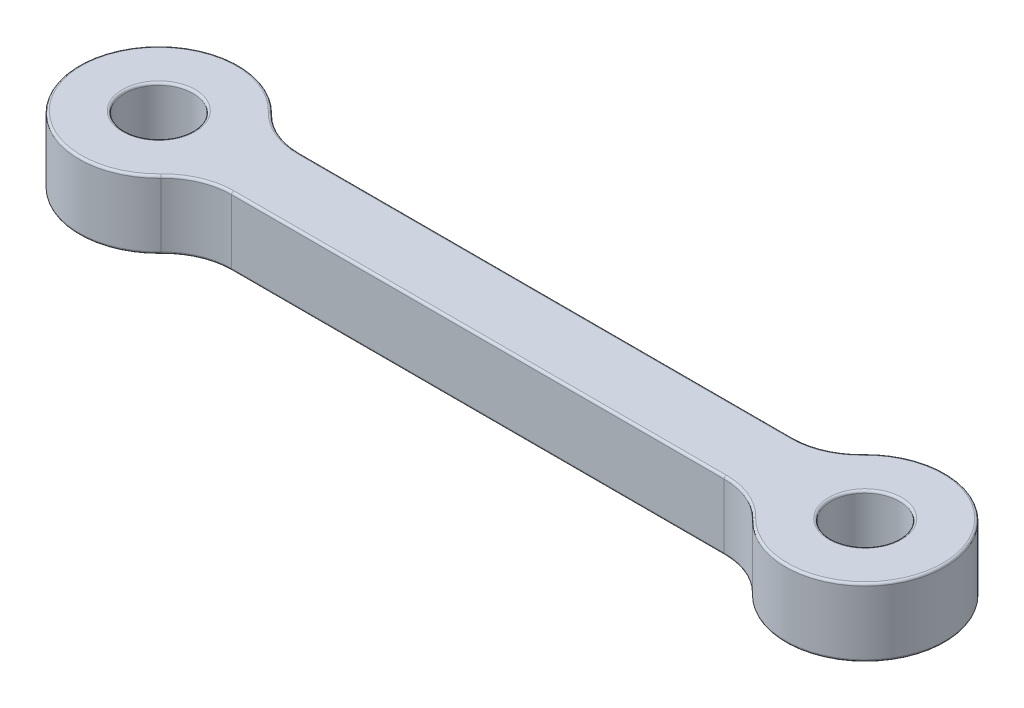
ISO-10303-21;
HEADER;
FILE_DESCRIPTION(('STEP AP214'),'2;1');
FILE_NAME('part.step','',(''),(''),'','','');
FILE_SCHEMA(('AUTOMOTIVE_DESIGN { 1 0 10303 214 1 1 1 1 }'));
ENDSEC;
DATA;
#1=APPLICATION_CONTEXT('core data for automotive mechanical design processes');
#2=APPLICATION_PROTOCOL_DEFINITION('international standard','automotive_design',2000,#1);
#3=PRODUCT_CONTEXT('',#1,'mechanical');
#4=PRODUCT('Part','Part','',(#3));
#5=PRODUCT_RELATED_PRODUCT_CATEGORY('part','',(#4));
#6=PRODUCT_DEFINITION_FORMATION('','',#4);
#7=PRODUCT_DEFINITION_CONTEXT('part definition',#1,'design');
#8=PRODUCT_DEFINITION('design','',#6,#7);
#9=PRODUCT_DEFINITION_SHAPE('','',#8);
#10=(LENGTH_UNIT() NAMED_UNIT(*) SI_UNIT(.MILLI.,.METRE.));
#11=(NAMED_UNIT(*) PLANE_ANGLE_UNIT() SI_UNIT($,.RADIAN.));
#12=(NAMED_UNIT(*) SI_UNIT($,.STERADIAN.) SOLID_ANGLE_UNIT());
#13=UNCERTAINTY_MEASURE_WITH_UNIT(LENGTH_MEASURE(1.E-05),#10,'distance_accuracy_value','');
#14=(GEOMETRIC_REPRESENTATION_CONTEXT(3) GLOBAL_UNCERTAINTY_ASSIGNED_CONTEXT((#13)) GLOBAL_UNIT_ASSIGNED_CONTEXT((#10,
#11,#12)) REPRESENTATION_CONTEXT('',''));
#15=CARTESIAN_POINT('',(0.,0.,0.));
#16=DIRECTION('',(0.,0.,1.));
#17=DIRECTION('',(1.,0.,0.));
#18=AXIS2_PLACEMENT_3D('',#15,#16,#17);
#19=CARTESIAN_POINT('',(0.,3.,-1.5));
#20=DIRECTION('',(0.,0.,-1.));
#21=DIRECTION('',(-1.,0.,0.));
#22=AXIS2_PLACEMENT_3D('',#19,#20,#21);
#23=PLANE('',#22);
#24=DIRECTION('',(0.,-1.,0.));
#25=VECTOR('',#24,1.);
#26=CARTESIAN_POINT('',(26.3095842401766,3.,-1.5));
#27=LINE('',#26,#25);
#28=CARTESIAN_POINT('',(26.3095842401766,2.9,-1.5));
#29=VERTEX_POINT('',#28);
#30=CARTESIAN_POINT('',(26.3095842401766,0.0999999999999998,-1.5));
#31=VERTEX_POINT('',#30);
#32=EDGE_CURVE('E348',#29,#31,#27,.T.);
#33=ORIENTED_EDGE('',*,*,#32,.T.);
#34=DIRECTION('',(1.,0.,0.));
#35=VECTOR('',#34,1.);
#36=CARTESIAN_POINT('',(4.69041575982343,0.1,-1.5));
#37=LINE('',#36,#35);
#38=CARTESIAN_POINT('',(4.69041575982343,0.0999999999999998,-1.5));
#39=VERTEX_POINT('',#38);
#40=EDGE_CURVE('E273',#31,#39,#37,.F.);
#41=ORIENTED_EDGE('',*,*,#40,.T.);
#42=DIRECTION('',(0.,-1.,0.));
#43=VECTOR('',#42,1.);
#44=CARTESIAN_POINT('',(4.69041575982343,3.,-1.5));
#45=LINE('',#44,#43);
#46=CARTESIAN_POINT('',(4.69041575982343,2.9,-1.5));
#47=VERTEX_POINT('',#46);
#48=EDGE_CURVE('E180',#47,#39,#45,.T.);
#49=ORIENTED_EDGE('',*,*,#48,.F.);
#50=DIRECTION('',(1.,0.,0.));
#51=VECTOR('',#50,1.);
#52=CARTESIAN_POINT('',(0.,2.9,-1.5));
#53=LINE('',#52,#51);
#54=EDGE_CURVE('E270',#47,#29,#53,.T.);
#55=ORIENTED_EDGE('',*,*,#54,.T.);
#56=EDGE_LOOP('',(#33,#41,#49,#55));
#57=FACE_BOUND('',#56,.T.);
#58=ADVANCED_FACE('F41',(#57),#23,.T.);
#59=CARTESIAN_POINT('',(4.69041575982343,3.,-4.5));
#60=DIRECTION('',(0.,-1.,0.));
#61=DIRECTION('',(0.,0.,-1.));
#62=AXIS2_PLACEMENT_3D('',#59,#60,#61);
#63=CYLINDRICAL_SURFACE('',#62,3.);
#64=ORIENTED_EDGE('',*,*,#48,.T.);
#65=CARTESIAN_POINT('',(4.69041575982343,0.0999999999999998,-4.5));
#66=DIRECTION('',(0.,1.,0.));
#67=DIRECTION('',(0.,0.,1.));
#68=AXIS2_PLACEMENT_3D('',#65,#66,#67);
#69=CIRCLE('',#68,3.);
#70=CARTESIAN_POINT('',(2.52560848605877,0.0999999999999998,-2.42307692307692));
#71=VERTEX_POINT('',#70);
#72=EDGE_CURVE('E178',#39,#71,#69,.F.);
#73=ORIENTED_EDGE('',*,*,#72,.T.);
#74=DIRECTION('',(0.,-1.,0.));
#75=VECTOR('',#74,1.);
#76=CARTESIAN_POINT('',(2.52560848605877,3.,-2.42307692307692));
#77=LINE('',#76,#75);
#78=CARTESIAN_POINT('',(2.52560848605877,2.9,-2.42307692307692));
#79=VERTEX_POINT('',#78);
#80=EDGE_CURVE('E159',#79,#71,#77,.T.);
#81=ORIENTED_EDGE('',*,*,#80,.F.);
#82=CARTESIAN_POINT('',(4.69041575982343,2.9,-4.5));
#83=DIRECTION('',(0.,1.,0.));
#84=DIRECTION('',(0.,0.,1.));
#85=AXIS2_PLACEMENT_3D('',#82,#83,#84);
#86=CIRCLE('',#85,3.);
#87=EDGE_CURVE('E175',#79,#47,#86,.T.);
#88=ORIENTED_EDGE('',*,*,#87,.T.);
#89=EDGE_LOOP('',(#64,#73,#81,#88));
#90=FACE_BOUND('',#89,.T.);
#91=ADVANCED_FACE('F173',(#90),#63,.F.);
#92=CARTESIAN_POINT('',(0.,3.,0.));
#93=DIRECTION('',(0.,-1.,0.));
#94=DIRECTION('',(0.,0.,-1.));
#95=AXIS2_PLACEMENT_3D('',#92,#93,#94);
#96=CYLINDRICAL_SURFACE('',#95,3.5);
#97=ORIENTED_EDGE('',*,*,#80,.T.);
#98=CARTESIAN_POINT('',(0.,0.0999999999999998,0.));
#99=DIRECTION('',(0.,1.,0.));
#100=DIRECTION('',(0.,0.,1.));
#101=AXIS2_PLACEMENT_3D('',#98,#99,#100);
#102=CIRCLE('',#101,3.5);
#103=CARTESIAN_POINT('',(2.52560848605877,0.0999999999999998,2.42307692307692));
#104=VERTEX_POINT('',#103);
#105=EDGE_CURVE('E167',#71,#104,#102,.T.);
#106=ORIENTED_EDGE('',*,*,#105,.T.);
#107=DIRECTION('',(0.,-1.,0.));
#108=VECTOR('',#107,1.);
#109=CARTESIAN_POINT('',(2.52560848605877,3.,2.42307692307692));
#110=LINE('',#109,#108);
#111=CARTESIAN_POINT('',(2.52560848605877,2.9,2.42307692307692));
#112=VERTEX_POINT('',#111);
#113=EDGE_CURVE('E161',#112,#104,#110,.T.);
#114=ORIENTED_EDGE('',*,*,#113,.F.);
#115=CARTESIAN_POINT('',(0.,2.9,0.));
#116=DIRECTION('',(0.,1.,0.));
#117=DIRECTION('',(0.,0.,1.));
#118=AXIS2_PLACEMENT_3D('',#115,#116,#117);
#119=CIRCLE('',#118,3.5);
#120=EDGE_CURVE('E156',#112,#79,#119,.F.);
#121=ORIENTED_EDGE('',*,*,#120,.T.);
#122=EDGE_LOOP('',(#97,#106,#114,#121));
#123=FACE_BOUND('',#122,.T.);
#124=ADVANCED_FACE('F158',(#123),#96,.T.);
#125=CARTESIAN_POINT('',(4.69041575982343,3.,4.5));
#126=DIRECTION('',(0.,-1.,0.));
#127=DIRECTION('',(0.,0.,-1.));
#128=AXIS2_PLACEMENT_3D('',#125,#126,#127);
#129=CYLINDRICAL_SURFACE('',#128,3.);
#130=ORIENTED_EDGE('',*,*,#113,.T.);
#131=CARTESIAN_POINT('',(4.69041575982343,0.0999999999999998,4.5));
#132=DIRECTION('',(0.,1.,0.));
#133=DIRECTION('',(0.,0.,1.));
#134=AXIS2_PLACEMENT_3D('',#131,#132,#133);
#135=CIRCLE('',#134,3.);
#136=CARTESIAN_POINT('',(4.69041575982343,0.0999999999999998,1.5));
#137=VERTEX_POINT('',#136);
#138=EDGE_CURVE('E242',#104,#137,#135,.F.);
#139=ORIENTED_EDGE('',*,*,#138,.T.);
#140=DIRECTION('',(0.,-1.,0.));
#141=VECTOR('',#140,1.);
#142=CARTESIAN_POINT('',(4.69041575982343,3.,1.5));
#143=LINE('',#142,#141);
#144=CARTESIAN_POINT('',(4.69041575982343,2.9,1.5));
#145=VERTEX_POINT('',#144);
#146=EDGE_CURVE('E405',#145,#137,#143,.T.);
#147=ORIENTED_EDGE('',*,*,#146,.F.);
#148=CARTESIAN_POINT('',(4.69041575982343,2.9,4.5));
#149=DIRECTION('',(0.,1.,0.));
#150=DIRECTION('',(0.,0.,1.));
#151=AXIS2_PLACEMENT_3D('',#148,#149,#150);
#152=CIRCLE('',#151,3.);
#153=EDGE_CURVE('E239',#145,#112,#152,.T.);
#154=ORIENTED_EDGE('',*,*,#153,.T.);
#155=EDGE_LOOP('',(#130,#139,#147,#154));
#156=FACE_BOUND('',#155,.T.);
#157=ADVANCED_FACE('F412',(#156),#129,.F.);
#158=CARTESIAN_POINT('',(0.,3.,1.5));
#159=DIRECTION('',(0.,0.,-1.));
#160=DIRECTION('',(-1.,0.,0.));
#161=AXIS2_PLACEMENT_3D('',#158,#159,#160);
#162=PLANE('',#161);
#163=ORIENTED_EDGE('',*,*,#146,.T.);
#164=DIRECTION('',(1.,0.,0.));
#165=VECTOR('',#164,1.);
#166=CARTESIAN_POINT('',(0.,0.0999999999999998,1.5));
#167=LINE('',#166,#165);
#168=CARTESIAN_POINT('',(26.3095842401766,0.0999999999999998,1.5));
#169=VERTEX_POINT('',#168);
#170=EDGE_CURVE('E248',#137,#169,#167,.T.);
#171=ORIENTED_EDGE('',*,*,#170,.T.);
#172=DIRECTION('',(0.,-1.,0.));
#173=VECTOR('',#172,1.);
#174=CARTESIAN_POINT('',(26.3095842401766,3.,1.5));
#175=LINE('',#174,#173);
#176=CARTESIAN_POINT('',(26.3095842401766,2.9,1.5));
#177=VERTEX_POINT('',#176);
#178=EDGE_CURVE('E401',#177,#169,#175,.T.);
#179=ORIENTED_EDGE('',*,*,#178,.F.);
#180=DIRECTION('',(1.,0.,0.));
#181=VECTOR('',#180,1.);
#182=CARTESIAN_POINT('',(4.69041575982343,2.9,1.5));
#183=LINE('',#182,#181);
#184=EDGE_CURVE('E245',#177,#145,#183,.F.);
#185=ORIENTED_EDGE('',*,*,#184,.T.);
#186=EDGE_LOOP('',(#163,#171,#179,#185));
#187=FACE_BOUND('',#186,.T.);
#188=ADVANCED_FACE('F455',(#187),#162,.F.);
#189=CARTESIAN_POINT('',(26.3095842401766,3.,4.5));
#190=DIRECTION('',(0.,-1.,0.));
#191=DIRECTION('',(0.,0.,-1.));
#192=AXIS2_PLACEMENT_3D('',#189,#190,#191);
#193=CYLINDRICAL_SURFACE('',#192,3.);
#194=ORIENTED_EDGE('',*,*,#178,.T.);
#195=CARTESIAN_POINT('',(26.3095842401766,0.0999999999999998,4.5));
#196=DIRECTION('',(0.,1.,0.));
#197=DIRECTION('',(0.,0.,1.));
#198=AXIS2_PLACEMENT_3D('',#195,#196,#197);
#199=CIRCLE('',#198,3.);
#200=CARTESIAN_POINT('',(28.4743915139412,0.0999999999999998,2.42307692307692));
#201=VERTEX_POINT('',#200);
#202=EDGE_CURVE('E254',#169,#201,#199,.F.);
#203=ORIENTED_EDGE('',*,*,#202,.T.);
#204=DIRECTION('',(0.,-1.,0.));
#205=VECTOR('',#204,1.);
#206=CARTESIAN_POINT('',(28.4743915139412,3.,2.42307692307692));
#207=LINE('',#206,#205);
#208=CARTESIAN_POINT('',(28.4743915139412,2.9,2.42307692307692));
#209=VERTEX_POINT('',#208);
#210=EDGE_CURVE('E395',#209,#201,#207,.T.);
#211=ORIENTED_EDGE('',*,*,#210,.F.);
#212=CARTESIAN_POINT('',(26.3095842401766,2.9,4.5));
#213=DIRECTION('',(0.,1.,0.));
#214=DIRECTION('',(0.,0.,1.));
#215=AXIS2_PLACEMENT_3D('',#212,#213,#214);
#216=CIRCLE('',#215,3.);
#217=EDGE_CURVE('E251',#209,#177,#216,.T.);
#218=ORIENTED_EDGE('',*,*,#217,.T.);
#219=EDGE_LOOP('',(#194,#203,#211,#218));
#220=FACE_BOUND('',#219,.T.);
#221=ADVANCED_FACE('F457',(#220),#193,.F.);
#222=CARTESIAN_POINT('',(31.,3.,0.));
#223=DIRECTION('',(0.,-1.,0.));
#224=DIRECTION('',(0.,0.,-1.));
#225=AXIS2_PLACEMENT_3D('',#222,#223,#224);
#226=CYLINDRICAL_SURFACE('',#225,3.5);
#227=ORIENTED_EDGE('',*,*,#210,.T.);
#228=CARTESIAN_POINT('',(31.,0.0999999999999998,0.));
#229=DIRECTION('',(0.,1.,0.));
#230=DIRECTION('',(0.,0.,1.));
#231=AXIS2_PLACEMENT_3D('',#228,#229,#230);
#232=CIRCLE('',#231,3.5);
#233=CARTESIAN_POINT('',(28.4743915139412,0.0999999999999998,-2.42307692307692));
#234=VERTEX_POINT('',#233);
#235=EDGE_CURVE('E260',#201,#234,#232,.T.);
#236=ORIENTED_EDGE('',*,*,#235,.T.);
#237=DIRECTION('',(0.,-1.,0.));
#238=VECTOR('',#237,1.);
#239=CARTESIAN_POINT('',(28.4743915139412,3.,-2.42307692307692));
#240=LINE('',#239,#238);
#241=CARTESIAN_POINT('',(28.4743915139412,2.9,-2.42307692307692));
#242=VERTEX_POINT('',#241);
#243=EDGE_CURVE('E392',#242,#234,#240,.T.);
#244=ORIENTED_EDGE('',*,*,#243,.F.);
#245=CARTESIAN_POINT('',(31.,2.9,0.));
#246=DIRECTION('',(0.,1.,0.));
#247=DIRECTION('',(0.,0.,1.));
#248=AXIS2_PLACEMENT_3D('',#245,#246,#247);
#249=CIRCLE('',#248,3.5);
#250=EDGE_CURVE('E257',#242,#209,#249,.F.);
#251=ORIENTED_EDGE('',*,*,#250,.T.);
#252=EDGE_LOOP('',(#227,#236,#244,#251));
#253=FACE_BOUND('',#252,.T.);
#254=ADVANCED_FACE('F490',(#253),#226,.T.);
#255=CARTESIAN_POINT('',(31.,3.,0.));
#256=DIRECTION('',(0.,-1.,0.));
#257=DIRECTION('',(0.,0.,-1.));
#258=AXIS2_PLACEMENT_3D('',#255,#256,#257);
#259=CYLINDRICAL_SURFACE('',#258,1.5);
#260=CARTESIAN_POINT('',(31.,0.0999999999999998,0.));
#261=DIRECTION('',(0.,1.,0.));
#262=DIRECTION('',(0.,0.,1.));
#263=AXIS2_PLACEMENT_3D('',#260,#261,#262);
#264=CIRCLE('',#263,1.5);
#265=CARTESIAN_POINT('',(31.,0.0999999999999998,1.5));
#266=VERTEX_POINT('',#265);
#267=EDGE_CURVE('E280',#266,#266,#264,.F.);
#268=ORIENTED_EDGE('',*,*,#267,.T.);
#269=EDGE_LOOP('',(#268));
#270=FACE_BOUND('',#269,.T.);
#271=CARTESIAN_POINT('',(31.,2.9,0.));
#272=DIRECTION('',(0.,1.,0.));
#273=DIRECTION('',(0.,0.,1.));
#274=AXIS2_PLACEMENT_3D('',#271,#272,#273);
#275=CIRCLE('',#274,1.5);
#276=CARTESIAN_POINT('',(31.,2.9,1.5));
#277=VERTEX_POINT('',#276);
#278=EDGE_CURVE('E276',#277,#277,#275,.T.);
#279=ORIENTED_EDGE('',*,*,#278,.T.);
#280=EDGE_LOOP('',(#279));
#281=FACE_BOUND('',#280,.T.);
#282=ADVANCED_FACE('F486',(#270,#281),#259,.F.);
#283=CARTESIAN_POINT('',(0.,3.,0.));
#284=DIRECTION('',(0.,-1.,0.));
#285=DIRECTION('',(0.,0.,-1.));
#286=AXIS2_PLACEMENT_3D('',#283,#284,#285);
#287=CYLINDRICAL_SURFACE('',#286,1.5);
#288=CARTESIAN_POINT('',(0.,0.0999999999999998,0.));
#289=DIRECTION('',(0.,1.,0.));
#290=DIRECTION('',(0.,0.,1.));
#291=AXIS2_PLACEMENT_3D('',#288,#289,#290);
#292=CIRCLE('',#291,1.5);
#293=CARTESIAN_POINT('',(0.,0.0999999999999998,1.5));
#294=VERTEX_POINT('',#293);
#295=EDGE_CURVE('E288',#294,#294,#292,.F.);
#296=ORIENTED_EDGE('',*,*,#295,.T.);
#297=EDGE_LOOP('',(#296));
#298=FACE_BOUND('',#297,.T.);
#299=CARTESIAN_POINT('',(0.,2.9,0.));
#300=DIRECTION('',(0.,1.,0.));
#301=DIRECTION('',(0.,0.,1.));
#302=AXIS2_PLACEMENT_3D('',#299,#300,#301);
#303=CIRCLE('',#302,1.5);
#304=CARTESIAN_POINT('',(0.,2.9,1.5));
#305=VERTEX_POINT('',#304);
#306=EDGE_CURVE('E284',#305,#305,#303,.T.);
#307=ORIENTED_EDGE('',*,*,#306,.T.);
#308=EDGE_LOOP('',(#307));
#309=FACE_BOUND('',#308,.T.);
#310=ADVANCED_FACE('F489',(#298,#309),#287,.F.);
#311=CARTESIAN_POINT('',(26.3095842401766,3.,-4.5));
#312=DIRECTION('',(0.,-1.,0.));
#313=DIRECTION('',(0.,0.,-1.));
#314=AXIS2_PLACEMENT_3D('',#311,#312,#313);
#315=CYLINDRICAL_SURFACE('',#314,3.);
#316=ORIENTED_EDGE('',*,*,#243,.T.);
#317=CARTESIAN_POINT('',(26.3095842401766,0.0999999999999998,-4.5));
#318=DIRECTION('',(0.,1.,0.));
#319=DIRECTION('',(0.,0.,1.));
#320=AXIS2_PLACEMENT_3D('',#317,#318,#319);
#321=CIRCLE('',#320,3.);
#322=EDGE_CURVE('E267',#234,#31,#321,.F.);
#323=ORIENTED_EDGE('',*,*,#322,.T.);
#324=ORIENTED_EDGE('',*,*,#32,.F.);
#325=CARTESIAN_POINT('',(26.3095842401766,2.9,-4.5));
#326=DIRECTION('',(0.,1.,0.));
#327=DIRECTION('',(0.,0.,1.));
#328=AXIS2_PLACEMENT_3D('',#325,#326,#327);
#329=CIRCLE('',#328,3.);
#330=EDGE_CURVE('E263',#29,#242,#329,.T.);
#331=ORIENTED_EDGE('',*,*,#330,.T.);
#332=EDGE_LOOP('',(#316,#323,#324,#331));
#333=FACE_BOUND('',#332,.T.);
#334=ADVANCED_FACE('F388',(#333),#315,.F.);
#335=CARTESIAN_POINT('',(0.,3.,0.));
#336=DIRECTION('',(0.,1.,0.));
#337=DIRECTION('',(0.,0.,1.));
#338=AXIS2_PLACEMENT_3D('',#335,#336,#337);
#339=PLANE('',#338);
#340=CARTESIAN_POINT('',(31.,3.,0.));
#341=DIRECTION('',(0.,1.,0.));
#342=DIRECTION('',(0.,0.,1.));
#343=AXIS2_PLACEMENT_3D('',#340,#341,#342);
#344=CIRCLE('',#343,3.4);
#345=CARTESIAN_POINT('',(28.5465517564001,3.,2.35384615384616));
#346=VERTEX_POINT('',#345);
#347=CARTESIAN_POINT('',(28.5465517564001,3.,-2.35384615384616));
#348=VERTEX_POINT('',#347);
#349=EDGE_CURVE('E51',#346,#348,#344,.T.);
#350=ORIENTED_EDGE('',*,*,#349,.T.);
#351=CARTESIAN_POINT('',(26.3095842401766,3.,-4.5));
#352=DIRECTION('',(0.,1.,0.));
#353=DIRECTION('',(0.,0.,1.));
#354=AXIS2_PLACEMENT_3D('',#351,#352,#353);
#355=CIRCLE('',#354,3.1);
#356=CARTESIAN_POINT('',(26.3095842401766,3.,-1.4));
#357=VERTEX_POINT('',#356);
#358=EDGE_CURVE('E11',#348,#357,#355,.F.);
#359=ORIENTED_EDGE('',*,*,#358,.T.);
#360=DIRECTION('',(1.,0.,0.));
#361=VECTOR('',#360,1.);
#362=CARTESIAN_POINT('',(0.,3.,-1.4));
#363=LINE('',#362,#361);
#364=CARTESIAN_POINT('',(4.69041575982343,3.,-1.4));
#365=VERTEX_POINT('',#364);
#366=EDGE_CURVE('E300',#357,#365,#363,.F.);
#367=ORIENTED_EDGE('',*,*,#366,.T.);
#368=CARTESIAN_POINT('',(4.69041575982343,3.,-4.5));
#369=DIRECTION('',(0.,1.,0.));
#370=DIRECTION('',(0.,0.,1.));
#371=AXIS2_PLACEMENT_3D('',#368,#369,#370);
#372=CIRCLE('',#371,3.1);
#373=CARTESIAN_POINT('',(2.45344824359995,3.,-2.35384615384615));
#374=VERTEX_POINT('',#373);
#375=EDGE_CURVE('E303',#365,#374,#372,.F.);
#376=ORIENTED_EDGE('',*,*,#375,.T.);
#377=CARTESIAN_POINT('',(0.,3.,0.));
#378=DIRECTION('',(0.,1.,0.));
#379=DIRECTION('',(0.,0.,1.));
#380=AXIS2_PLACEMENT_3D('',#377,#378,#379);
#381=CIRCLE('',#380,3.4);
#382=CARTESIAN_POINT('',(2.45344824359995,3.,2.35384615384615));
#383=VERTEX_POINT('',#382);
#384=EDGE_CURVE('E186',#374,#383,#381,.T.);
#385=ORIENTED_EDGE('',*,*,#384,.T.);
#386=CARTESIAN_POINT('',(4.69041575982343,3.,4.5));
#387=DIRECTION('',(0.,1.,0.));
#388=DIRECTION('',(0.,0.,1.));
#389=AXIS2_PLACEMENT_3D('',#386,#387,#388);
#390=CIRCLE('',#389,3.1);
#391=CARTESIAN_POINT('',(4.69041575982343,3.,1.4));
#392=VERTEX_POINT('',#391);
#393=EDGE_CURVE('E308',#383,#392,#390,.F.);
#394=ORIENTED_EDGE('',*,*,#393,.T.);
#395=DIRECTION('',(1.,0.,0.));
#396=VECTOR('',#395,1.);
#397=CARTESIAN_POINT('',(26.3095842401766,3.,1.4));
#398=LINE('',#397,#396);
#399=CARTESIAN_POINT('',(26.3095842401766,3.,1.4));
#400=VERTEX_POINT('',#399);
#401=EDGE_CURVE('E311',#392,#400,#398,.T.);
#402=ORIENTED_EDGE('',*,*,#401,.T.);
#403=CARTESIAN_POINT('',(26.3095842401766,3.,4.5));
#404=DIRECTION('',(0.,1.,0.));
#405=DIRECTION('',(0.,0.,1.));
#406=AXIS2_PLACEMENT_3D('',#403,#404,#405);
#407=CIRCLE('',#406,3.1);
#408=EDGE_CURVE('E62',#400,#346,#407,.F.);
#409=ORIENTED_EDGE('',*,*,#408,.T.);
#410=EDGE_LOOP('',(#350,#359,#367,#376,#385,#394,#402,#409));
#411=FACE_BOUND('',#410,.T.);
#412=CARTESIAN_POINT('',(31.,3.,0.));
#413=DIRECTION('',(0.,1.,0.));
#414=DIRECTION('',(0.,0.,1.));
#415=AXIS2_PLACEMENT_3D('',#412,#413,#414);
#416=CIRCLE('',#415,1.6);
#417=CARTESIAN_POINT('',(31.,3.,1.6));
#418=VERTEX_POINT('',#417);
#419=EDGE_CURVE('E296',#418,#418,#416,.F.);
#420=ORIENTED_EDGE('',*,*,#419,.T.);
#421=EDGE_LOOP('',(#420));
#422=FACE_BOUND('',#421,.T.);
#423=CARTESIAN_POINT('',(0.,3.,0.));
#424=DIRECTION('',(0.,1.,0.));
#425=DIRECTION('',(0.,0.,1.));
#426=AXIS2_PLACEMENT_3D('',#423,#424,#425);
#427=CIRCLE('',#426,1.6);
#428=CARTESIAN_POINT('',(0.,3.,1.6));
#429=VERTEX_POINT('',#428);
#430=EDGE_CURVE('E292',#429,#429,#427,.F.);
#431=ORIENTED_EDGE('',*,*,#430,.T.);
#432=EDGE_LOOP('',(#431));
#433=FACE_BOUND('',#432,.T.);
#434=ADVANCED_FACE('F374',(#411,#422,#433),#339,.T.);
#435=CARTESIAN_POINT('',(0.,0.,0.));
#436=DIRECTION('',(0.,1.,0.));
#437=DIRECTION('',(0.,0.,1.));
#438=AXIS2_PLACEMENT_3D('',#435,#436,#437);
#439=PLANE('',#438);
#440=CARTESIAN_POINT('',(0.,0.,0.));
#441=DIRECTION('',(0.,1.,0.));
#442=DIRECTION('',(0.,0.,1.));
#443=AXIS2_PLACEMENT_3D('',#440,#441,#442);
#444=CIRCLE('',#443,3.4);
#445=CARTESIAN_POINT('',(2.45344824359995,0.,2.35384615384615));
#446=VERTEX_POINT('',#445);
#447=CARTESIAN_POINT('',(2.45344824359995,0.,-2.35384615384615));
#448=VERTEX_POINT('',#447);
#449=EDGE_CURVE('E231',#446,#448,#444,.F.);
#450=ORIENTED_EDGE('',*,*,#449,.T.);
#451=CARTESIAN_POINT('',(4.69041575982343,0.,-4.5));
#452=DIRECTION('',(0.,1.,0.));
#453=DIRECTION('',(0.,0.,1.));
#454=AXIS2_PLACEMENT_3D('',#451,#452,#453);
#455=CIRCLE('',#454,3.1);
#456=CARTESIAN_POINT('',(4.69041575982343,0.,-1.4));
#457=VERTEX_POINT('',#456);
#458=EDGE_CURVE('E168',#448,#457,#455,.T.);
#459=ORIENTED_EDGE('',*,*,#458,.T.);
#460=DIRECTION('',(1.,0.,0.));
#461=VECTOR('',#460,1.);
#462=CARTESIAN_POINT('',(26.3095842401766,0.,-1.4));
#463=LINE('',#462,#461);
#464=CARTESIAN_POINT('',(26.3095842401766,0.,-1.4));
#465=VERTEX_POINT('',#464);
#466=EDGE_CURVE('E213',#457,#465,#463,.T.);
#467=ORIENTED_EDGE('',*,*,#466,.T.);
#468=CARTESIAN_POINT('',(26.3095842401766,0.,-4.5));
#469=DIRECTION('',(0.,1.,0.));
#470=DIRECTION('',(0.,0.,1.));
#471=AXIS2_PLACEMENT_3D('',#468,#469,#470);
#472=CIRCLE('',#471,3.1);
#473=CARTESIAN_POINT('',(28.5465517564001,0.,-2.35384615384616));
#474=VERTEX_POINT('',#473);
#475=EDGE_CURVE('E216',#465,#474,#472,.T.);
#476=ORIENTED_EDGE('',*,*,#475,.T.);
#477=CARTESIAN_POINT('',(31.,0.,0.));
#478=DIRECTION('',(0.,1.,0.));
#479=DIRECTION('',(0.,0.,1.));
#480=AXIS2_PLACEMENT_3D('',#477,#478,#479);
#481=CIRCLE('',#480,3.4);
#482=CARTESIAN_POINT('',(28.5465517564001,0.,2.35384615384616));
#483=VERTEX_POINT('',#482);
#484=EDGE_CURVE('E219',#474,#483,#481,.F.);
#485=ORIENTED_EDGE('',*,*,#484,.T.);
#486=CARTESIAN_POINT('',(26.3095842401766,0.,4.5));
#487=DIRECTION('',(0.,1.,0.));
#488=DIRECTION('',(0.,0.,1.));
#489=AXIS2_PLACEMENT_3D('',#486,#487,#488);
#490=CIRCLE('',#489,3.1);
#491=CARTESIAN_POINT('',(26.3095842401766,0.,1.4));
#492=VERTEX_POINT('',#491);
#493=EDGE_CURVE('E222',#483,#492,#490,.T.);
#494=ORIENTED_EDGE('',*,*,#493,.T.);
#495=DIRECTION('',(1.,0.,0.));
#496=VECTOR('',#495,1.);
#497=CARTESIAN_POINT('',(0.,0.,1.4));
#498=LINE('',#497,#496);
#499=CARTESIAN_POINT('',(4.69041575982343,0.,1.4));
#500=VERTEX_POINT('',#499);
#501=EDGE_CURVE('E225',#492,#500,#498,.F.);
#502=ORIENTED_EDGE('',*,*,#501,.T.);
#503=CARTESIAN_POINT('',(4.69041575982343,0.,4.5));
#504=DIRECTION('',(0.,1.,0.));
#505=DIRECTION('',(0.,0.,1.));
#506=AXIS2_PLACEMENT_3D('',#503,#504,#505);
#507=CIRCLE('',#506,3.1);
#508=EDGE_CURVE('E228',#500,#446,#507,.T.);
#509=ORIENTED_EDGE('',*,*,#508,.T.);
#510=EDGE_LOOP('',(#450,#459,#467,#476,#485,#494,#502,#509));
#511=FACE_BOUND('',#510,.T.);
#512=CARTESIAN_POINT('',(31.,0.,0.));
#513=DIRECTION('',(0.,1.,0.));
#514=DIRECTION('',(0.,0.,1.));
#515=AXIS2_PLACEMENT_3D('',#512,#513,#514);
#516=CIRCLE('',#515,1.6);
#517=CARTESIAN_POINT('',(31.,0.,1.6));
#518=VERTEX_POINT('',#517);
#519=EDGE_CURVE('E209',#518,#518,#516,.T.);
#520=ORIENTED_EDGE('',*,*,#519,.T.);
#521=EDGE_LOOP('',(#520));
#522=FACE_BOUND('',#521,.T.);
#523=CARTESIAN_POINT('',(0.,0.,0.));
#524=DIRECTION('',(0.,1.,0.));
#525=DIRECTION('',(0.,0.,1.));
#526=AXIS2_PLACEMENT_3D('',#523,#524,#525);
#527=CIRCLE('',#526,1.6);
#528=CARTESIAN_POINT('',(0.,0.,1.6));
#529=VERTEX_POINT('',#528);
#530=EDGE_CURVE('E202',#529,#529,#527,.T.);
#531=ORIENTED_EDGE('',*,*,#530,.T.);
#532=EDGE_LOOP('',(#531));
#533=FACE_BOUND('',#532,.T.);
#534=ADVANCED_FACE('F426',(#511,#522,#533),#439,.F.);
#535=CARTESIAN_POINT('',(26.3095842401766,0.0999999999999998,4.5));
#536=DIRECTION('',(0.,1.,0.));
#537=DIRECTION('',(0.,0.,1.));
#538=AXIS2_PLACEMENT_3D('',#535,#536,#537);
#539=TOROIDAL_SURFACE('',#538,3.1,0.1);
#540=CARTESIAN_POINT('',(26.3095842401766,0.1,1.4));
#541=DIRECTION('',(-1.,0.,0.));
#542=DIRECTION('',(0.,0.,1.));
#543=AXIS2_PLACEMENT_3D('',#540,#541,#542);
#544=CIRCLE('',#543,0.1);
#545=EDGE_CURVE('E340',#492,#169,#544,.T.);
#546=ORIENTED_EDGE('',*,*,#545,.F.);
#547=ORIENTED_EDGE('',*,*,#493,.F.);
#548=CARTESIAN_POINT('',(28.5465517564001,0.0999999999999998,2.35384615384615));
#549=DIRECTION('',(0.692307692307693,0.,0.72160242458822));
#550=DIRECTION('',(0.72160242458822,0.,-0.692307692307693));
#551=AXIS2_PLACEMENT_3D('',#548,#549,#550);
#552=CIRCLE('',#551,0.1);
#553=EDGE_CURVE('E344',#201,#483,#552,.T.);
#554=ORIENTED_EDGE('',*,*,#553,.F.);
#555=ORIENTED_EDGE('',*,*,#202,.F.);
#556=EDGE_LOOP('',(#546,#547,#554,#555));
#557=FACE_BOUND('',#556,.T.);
#558=ADVANCED_FACE('F447',(#557),#539,.T.);
#559=CARTESIAN_POINT('',(31.,0.0999999999999998,0.));
#560=DIRECTION('',(0.,1.,0.));
#561=DIRECTION('',(0.,0.,1.));
#562=AXIS2_PLACEMENT_3D('',#559,#560,#561);
#563=TOROIDAL_SURFACE('',#562,3.4,0.1);
#564=ORIENTED_EDGE('',*,*,#553,.T.);
#565=ORIENTED_EDGE('',*,*,#484,.F.);
#566=CARTESIAN_POINT('',(28.5465517564001,0.0999999999999998,-2.35384615384615));
#567=DIRECTION('',(-0.692307692307693,0.,0.72160242458822));
#568=DIRECTION('',(0.72160242458822,0.,0.692307692307693));
#569=AXIS2_PLACEMENT_3D('',#566,#567,#568);
#570=CIRCLE('',#569,0.1);
#571=EDGE_CURVE('E336',#234,#474,#570,.T.);
#572=ORIENTED_EDGE('',*,*,#571,.F.);
#573=ORIENTED_EDGE('',*,*,#235,.F.);
#574=EDGE_LOOP('',(#564,#565,#572,#573));
#575=FACE_BOUND('',#574,.T.);
#576=ADVANCED_FACE('F442',(#575),#563,.T.);
#577=CARTESIAN_POINT('',(0.,0.0999999999999998,1.4));
#578=DIRECTION('',(1.,0.,0.));
#579=DIRECTION('',(0.,0.,-1.));
#580=AXIS2_PLACEMENT_3D('',#577,#578,#579);
#581=CYLINDRICAL_SURFACE('',#580,0.1);
#582=ORIENTED_EDGE('',*,*,#545,.T.);
#583=ORIENTED_EDGE('',*,*,#170,.F.);
#584=CARTESIAN_POINT('',(4.69041575982343,0.1,1.4));
#585=DIRECTION('',(-1.,0.,0.));
#586=DIRECTION('',(0.,0.,1.));
#587=AXIS2_PLACEMENT_3D('',#584,#585,#586);
#588=CIRCLE('',#587,0.1);
#589=EDGE_CURVE('E332',#500,#137,#588,.T.);
#590=ORIENTED_EDGE('',*,*,#589,.F.);
#591=ORIENTED_EDGE('',*,*,#501,.F.);
#592=EDGE_LOOP('',(#582,#583,#590,#591));
#593=FACE_BOUND('',#592,.T.);
#594=ADVANCED_FACE('F452',(#593),#581,.T.);
#595=CARTESIAN_POINT('',(26.3095842401766,0.0999999999999998,-4.5));
#596=DIRECTION('',(0.,1.,0.));
#597=DIRECTION('',(0.,0.,1.));
#598=AXIS2_PLACEMENT_3D('',#595,#596,#597);
#599=TOROIDAL_SURFACE('',#598,3.1,0.1);
#600=ORIENTED_EDGE('',*,*,#571,.T.);
#601=ORIENTED_EDGE('',*,*,#475,.F.);
#602=CARTESIAN_POINT('',(26.3095842401766,0.0999999999999998,-1.4));
#603=DIRECTION('',(-1.,0.,0.));
#604=DIRECTION('',(0.,0.,1.));
#605=AXIS2_PLACEMENT_3D('',#602,#603,#604);
#606=CIRCLE('',#605,0.1);
#607=EDGE_CURVE('E328',#31,#465,#606,.T.);
#608=ORIENTED_EDGE('',*,*,#607,.F.);
#609=ORIENTED_EDGE('',*,*,#322,.F.);
#610=EDGE_LOOP('',(#600,#601,#608,#609));
#611=FACE_BOUND('',#610,.T.);
#612=ADVANCED_FACE('F438',(#611),#599,.T.);
#613=CARTESIAN_POINT('',(4.69041575982343,0.0999999999999998,4.5));
#614=DIRECTION('',(0.,1.,0.));
#615=DIRECTION('',(0.,0.,1.));
#616=AXIS2_PLACEMENT_3D('',#613,#614,#615);
#617=TOROIDAL_SURFACE('',#616,3.1,0.1);
#618=ORIENTED_EDGE('',*,*,#589,.T.);
#619=ORIENTED_EDGE('',*,*,#138,.F.);
#620=CARTESIAN_POINT('',(2.45344824359995,0.1,2.35384615384615));
#621=DIRECTION('',(-0.692307692307693,0.,0.72160242458822));
#622=DIRECTION('',(0.72160242458822,0.,0.692307692307693));
#623=AXIS2_PLACEMENT_3D('',#620,#621,#622);
#624=CIRCLE('',#623,0.1);
#625=EDGE_CURVE('E324',#446,#104,#624,.T.);
#626=ORIENTED_EDGE('',*,*,#625,.F.);
#627=ORIENTED_EDGE('',*,*,#508,.F.);
#628=EDGE_LOOP('',(#618,#619,#626,#627));
#629=FACE_BOUND('',#628,.T.);
#630=ADVANCED_FACE('F416',(#629),#617,.T.);
#631=CARTESIAN_POINT('',(0.,0.1,-1.4));
#632=DIRECTION('',(-1.,0.,0.));
#633=DIRECTION('',(0.,0.,1.));
#634=AXIS2_PLACEMENT_3D('',#631,#632,#633);
#635=CYLINDRICAL_SURFACE('',#634,0.1);
#636=ORIENTED_EDGE('',*,*,#607,.T.);
#637=ORIENTED_EDGE('',*,*,#466,.F.);
#638=CARTESIAN_POINT('',(4.69041575982343,0.1,-1.4));
#639=DIRECTION('',(-1.,0.,0.));
#640=DIRECTION('',(0.,0.,1.));
#641=AXIS2_PLACEMENT_3D('',#638,#639,#640);
#642=CIRCLE('',#641,0.1);
#643=EDGE_CURVE('E321',#39,#457,#642,.T.);
#644=ORIENTED_EDGE('',*,*,#643,.F.);
#645=ORIENTED_EDGE('',*,*,#40,.F.);
#646=EDGE_LOOP('',(#636,#637,#644,#645));
#647=FACE_BOUND('',#646,.T.);
#648=ADVANCED_FACE('F434',(#647),#635,.T.);
#649=CARTESIAN_POINT('',(0.,0.0999999999999998,0.));
#650=DIRECTION('',(0.,1.,0.));
#651=DIRECTION('',(0.,0.,1.));
#652=AXIS2_PLACEMENT_3D('',#649,#650,#651);
#653=TOROIDAL_SURFACE('',#652,3.4,0.1);
#654=ORIENTED_EDGE('',*,*,#625,.T.);
#655=ORIENTED_EDGE('',*,*,#105,.F.);
#656=CARTESIAN_POINT('',(2.45344824359995,0.1,-2.35384615384615));
#657=DIRECTION('',(0.692307692307693,0.,0.72160242458822));
#658=DIRECTION('',(0.72160242458822,0.,-0.692307692307693));
#659=AXIS2_PLACEMENT_3D('',#656,#657,#658);
#660=CIRCLE('',#659,0.1);
#661=EDGE_CURVE('E318',#448,#71,#660,.T.);
#662=ORIENTED_EDGE('',*,*,#661,.F.);
#663=ORIENTED_EDGE('',*,*,#449,.F.);
#664=EDGE_LOOP('',(#654,#655,#662,#663));
#665=FACE_BOUND('',#664,.T.);
#666=ADVANCED_FACE('F422',(#665),#653,.T.);
#667=CARTESIAN_POINT('',(4.69041575982343,0.0999999999999998,-4.5));
#668=DIRECTION('',(0.,1.,0.));
#669=DIRECTION('',(0.,0.,1.));
#670=AXIS2_PLACEMENT_3D('',#667,#668,#669);
#671=TOROIDAL_SURFACE('',#670,3.1,0.1);
#672=ORIENTED_EDGE('',*,*,#643,.T.);
#673=ORIENTED_EDGE('',*,*,#458,.F.);
#674=ORIENTED_EDGE('',*,*,#661,.T.);
#675=ORIENTED_EDGE('',*,*,#72,.F.);
#676=EDGE_LOOP('',(#672,#673,#674,#675));
#677=FACE_BOUND('',#676,.T.);
#678=ADVANCED_FACE('F429',(#677),#671,.T.);
#679=CARTESIAN_POINT('',(31.,0.0999999999999998,0.));
#680=DIRECTION('',(0.,1.,0.));
#681=DIRECTION('',(0.,0.,1.));
#682=AXIS2_PLACEMENT_3D('',#679,#680,#681);
#683=TOROIDAL_SURFACE('',#682,1.6,0.1);
#684=ORIENTED_EDGE('',*,*,#267,.F.);
#685=EDGE_LOOP('',(#684));
#686=FACE_BOUND('',#685,.T.);
#687=ORIENTED_EDGE('',*,*,#519,.F.);
#688=EDGE_LOOP('',(#687));
#689=FACE_BOUND('',#688,.T.);
#690=ADVANCED_FACE('F497',(#686,#689),#683,.T.);
#691=CARTESIAN_POINT('',(0.,0.0999999999999998,0.));
#692=DIRECTION('',(0.,1.,0.));
#693=DIRECTION('',(0.,0.,1.));
#694=AXIS2_PLACEMENT_3D('',#691,#692,#693);
#695=TOROIDAL_SURFACE('',#694,1.6,0.1);
#696=ORIENTED_EDGE('',*,*,#295,.F.);
#697=EDGE_LOOP('',(#696));
#698=FACE_BOUND('',#697,.T.);
#699=ORIENTED_EDGE('',*,*,#530,.F.);
#700=EDGE_LOOP('',(#699));
#701=FACE_BOUND('',#700,.T.);
#702=ADVANCED_FACE('F513',(#698,#701),#695,.T.);
#703=CARTESIAN_POINT('',(4.69041575982343,2.9,4.5));
#704=DIRECTION('',(0.,1.,0.));
#705=DIRECTION('',(0.,0.,1.));
#706=AXIS2_PLACEMENT_3D('',#703,#704,#705);
#707=TOROIDAL_SURFACE('',#706,3.1,0.1);
#708=CARTESIAN_POINT('',(4.69041575982343,2.9,1.4));
#709=DIRECTION('',(1.,0.,0.));
#710=DIRECTION('',(0.,0.,-1.));
#711=AXIS2_PLACEMENT_3D('',#708,#709,#710);
#712=CIRCLE('',#711,0.1);
#713=EDGE_CURVE('E190',#392,#145,#712,.T.);
#714=ORIENTED_EDGE('',*,*,#713,.F.);
#715=ORIENTED_EDGE('',*,*,#393,.F.);
#716=CARTESIAN_POINT('',(2.45344824359995,2.9,2.35384615384615));
#717=DIRECTION('',(-0.692307692307693,0.,0.72160242458822));
#718=DIRECTION('',(0.72160242458822,0.,0.692307692307693));
#719=AXIS2_PLACEMENT_3D('',#716,#717,#718);
#720=CIRCLE('',#719,0.1);
#721=EDGE_CURVE('E45',#112,#383,#720,.T.);
#722=ORIENTED_EDGE('',*,*,#721,.F.);
#723=ORIENTED_EDGE('',*,*,#153,.F.);
#724=EDGE_LOOP('',(#714,#715,#722,#723));
#725=FACE_BOUND('',#724,.T.);
#726=ADVANCED_FACE('F373',(#725),#707,.T.);
#727=CARTESIAN_POINT('',(0.,2.9,0.));
#728=DIRECTION('',(0.,1.,0.));
#729=DIRECTION('',(0.,0.,1.));
#730=AXIS2_PLACEMENT_3D('',#727,#728,#729);
#731=TOROIDAL_SURFACE('',#730,3.4,0.1);
#732=ORIENTED_EDGE('',*,*,#721,.T.);
#733=ORIENTED_EDGE('',*,*,#384,.F.);
#734=CARTESIAN_POINT('',(2.45344824359995,2.9,-2.35384615384615));
#735=DIRECTION('',(0.692307692307693,0.,0.72160242458822));
#736=DIRECTION('',(0.72160242458822,0.,-0.692307692307693));
#737=AXIS2_PLACEMENT_3D('',#734,#735,#736);
#738=CIRCLE('',#737,0.1);
#739=EDGE_CURVE('E184',#79,#374,#738,.T.);
#740=ORIENTED_EDGE('',*,*,#739,.F.);
#741=ORIENTED_EDGE('',*,*,#120,.F.);
#742=EDGE_LOOP('',(#732,#733,#740,#741));
#743=FACE_BOUND('',#742,.T.);
#744=ADVANCED_FACE('F185',(#743),#731,.T.);
#745=CARTESIAN_POINT('',(0.,2.9,1.4));
#746=DIRECTION('',(-1.,0.,0.));
#747=DIRECTION('',(0.,0.,1.));
#748=AXIS2_PLACEMENT_3D('',#745,#746,#747);
#749=CYLINDRICAL_SURFACE('',#748,0.1);
#750=ORIENTED_EDGE('',*,*,#713,.T.);
#751=ORIENTED_EDGE('',*,*,#184,.F.);
#752=CARTESIAN_POINT('',(26.3095842401766,2.9,1.4));
#753=DIRECTION('',(1.,0.,0.));
#754=DIRECTION('',(0.,0.,-1.));
#755=AXIS2_PLACEMENT_3D('',#752,#753,#754);
#756=CIRCLE('',#755,0.1);
#757=EDGE_CURVE('E191',#400,#177,#756,.T.);
#758=ORIENTED_EDGE('',*,*,#757,.F.);
#759=ORIENTED_EDGE('',*,*,#401,.F.);
#760=EDGE_LOOP('',(#750,#751,#758,#759));
#761=FACE_BOUND('',#760,.T.);
#762=ADVANCED_FACE('F656',(#761),#749,.T.);
#763=CARTESIAN_POINT('',(4.69041575982343,2.9,-4.5));
#764=DIRECTION('',(0.,1.,0.));
#765=DIRECTION('',(0.,0.,1.));
#766=AXIS2_PLACEMENT_3D('',#763,#764,#765);
#767=TOROIDAL_SURFACE('',#766,3.1,0.1);
#768=ORIENTED_EDGE('',*,*,#739,.T.);
#769=ORIENTED_EDGE('',*,*,#375,.F.);
#770=CARTESIAN_POINT('',(4.69041575982343,2.9,-1.4));
#771=DIRECTION('',(1.,0.,0.));
#772=DIRECTION('',(0.,0.,-1.));
#773=AXIS2_PLACEMENT_3D('',#770,#771,#772);
#774=CIRCLE('',#773,0.1);
#775=EDGE_CURVE('E196',#47,#365,#774,.T.);
#776=ORIENTED_EDGE('',*,*,#775,.F.);
#777=ORIENTED_EDGE('',*,*,#87,.F.);
#778=EDGE_LOOP('',(#768,#769,#776,#777));
#779=FACE_BOUND('',#778,.T.);
#780=ADVANCED_FACE('F194',(#779),#767,.T.);
#781=CARTESIAN_POINT('',(26.3095842401766,2.9,4.5));
#782=DIRECTION('',(0.,1.,0.));
#783=DIRECTION('',(0.,0.,1.));
#784=AXIS2_PLACEMENT_3D('',#781,#782,#783);
#785=TOROIDAL_SURFACE('',#784,3.1,0.1);
#786=ORIENTED_EDGE('',*,*,#757,.T.);
#787=ORIENTED_EDGE('',*,*,#217,.F.);
#788=CARTESIAN_POINT('',(28.5465517564001,2.9,2.35384615384616));
#789=DIRECTION('',(0.69230769230769,0.,0.721602424588222));
#790=DIRECTION('',(0.721602424588222,0.,-0.69230769230769));
#791=AXIS2_PLACEMENT_3D('',#788,#789,#790);
#792=CIRCLE('',#791,0.1);
#793=EDGE_CURVE('E355',#346,#209,#792,.T.);
#794=ORIENTED_EDGE('',*,*,#793,.F.);
#795=ORIENTED_EDGE('',*,*,#408,.F.);
#796=EDGE_LOOP('',(#786,#787,#794,#795));
#797=FACE_BOUND('',#796,.T.);
#798=ADVANCED_FACE('F461',(#797),#785,.T.);
#799=CARTESIAN_POINT('',(0.,2.9,-1.4));
#800=DIRECTION('',(1.,0.,0.));
#801=DIRECTION('',(0.,0.,-1.));
#802=AXIS2_PLACEMENT_3D('',#799,#800,#801);
#803=CYLINDRICAL_SURFACE('',#802,0.1);
#804=ORIENTED_EDGE('',*,*,#775,.T.);
#805=ORIENTED_EDGE('',*,*,#366,.F.);
#806=CARTESIAN_POINT('',(26.3095842401766,2.9,-1.4));
#807=DIRECTION('',(1.,0.,0.));
#808=DIRECTION('',(0.,0.,-1.));
#809=AXIS2_PLACEMENT_3D('',#806,#807,#808);
#810=CIRCLE('',#809,0.1);
#811=EDGE_CURVE('E352',#29,#357,#810,.T.);
#812=ORIENTED_EDGE('',*,*,#811,.F.);
#813=ORIENTED_EDGE('',*,*,#54,.F.);
#814=EDGE_LOOP('',(#804,#805,#812,#813));
#815=FACE_BOUND('',#814,.T.);
#816=ADVANCED_FACE('F379',(#815),#803,.T.);
#817=CARTESIAN_POINT('',(31.,2.9,0.));
#818=DIRECTION('',(0.,1.,0.));
#819=DIRECTION('',(0.,0.,1.));
#820=AXIS2_PLACEMENT_3D('',#817,#818,#819);
#821=TOROIDAL_SURFACE('',#820,3.4,0.1);
#822=ORIENTED_EDGE('',*,*,#793,.T.);
#823=ORIENTED_EDGE('',*,*,#250,.F.);
#824=CARTESIAN_POINT('',(28.5465517564001,2.9,-2.35384615384616));
#825=DIRECTION('',(-0.69230769230769,0.,0.721602424588222));
#826=DIRECTION('',(0.721602424588222,0.,0.69230769230769));
#827=AXIS2_PLACEMENT_3D('',#824,#825,#826);
#828=CIRCLE('',#827,0.1);
#829=EDGE_CURVE('E349',#348,#242,#828,.T.);
#830=ORIENTED_EDGE('',*,*,#829,.F.);
#831=ORIENTED_EDGE('',*,*,#349,.F.);
#832=EDGE_LOOP('',(#822,#823,#830,#831));
#833=FACE_BOUND('',#832,.T.);
#834=ADVANCED_FACE('F464',(#833),#821,.T.);
#835=CARTESIAN_POINT('',(26.3095842401766,2.9,-4.5));
#836=DIRECTION('',(0.,1.,0.));
#837=DIRECTION('',(0.,0.,1.));
#838=AXIS2_PLACEMENT_3D('',#835,#836,#837);
#839=TOROIDAL_SURFACE('',#838,3.1,0.1);
#840=ORIENTED_EDGE('',*,*,#811,.T.);
#841=ORIENTED_EDGE('',*,*,#358,.F.);
#842=ORIENTED_EDGE('',*,*,#829,.T.);
#843=ORIENTED_EDGE('',*,*,#330,.F.);
#844=EDGE_LOOP('',(#840,#841,#842,#843));
#845=FACE_BOUND('',#844,.T.);
#846=ADVANCED_FACE('F467',(#845),#839,.T.);
#847=CARTESIAN_POINT('',(31.,2.9,0.));
#848=DIRECTION('',(0.,1.,0.));
#849=DIRECTION('',(0.,0.,1.));
#850=AXIS2_PLACEMENT_3D('',#847,#848,#849);
#851=TOROIDAL_SURFACE('',#850,1.6,0.1);
#852=ORIENTED_EDGE('',*,*,#419,.F.);
#853=EDGE_LOOP('',(#852));
#854=FACE_BOUND('',#853,.T.);
#855=ORIENTED_EDGE('',*,*,#278,.F.);
#856=EDGE_LOOP('',(#855));
#857=FACE_BOUND('',#856,.T.);
#858=ADVANCED_FACE('F469',(#854,#857),#851,.T.);
#859=CARTESIAN_POINT('',(0.,2.9,0.));
#860=DIRECTION('',(0.,1.,0.));
#861=DIRECTION('',(0.,0.,1.));
#862=AXIS2_PLACEMENT_3D('',#859,#860,#861);
#863=TOROIDAL_SURFACE('',#862,1.6,0.1);
#864=ORIENTED_EDGE('',*,*,#430,.F.);
#865=EDGE_LOOP('',(#864));
#866=FACE_BOUND('',#865,.T.);
#867=ORIENTED_EDGE('',*,*,#306,.F.);
#868=EDGE_LOOP('',(#867));
#869=FACE_BOUND('',#868,.T.);
#870=ADVANCED_FACE('F43',(#866,#869),#863,.T.);
#871=CLOSED_SHELL('',(#58,#91,#124,#157,#188,#221,#254,#282,#310,#334,#434,#534,#558,#576,#594,
#612,#630,#648,#666,#678,#690,#702,#726,#744,#762,#780,#798,#816,#834,#846,#858,#870));
#872=MANIFOLD_SOLID_BREP('B2',#871);
#873=ADVANCED_BREP_SHAPE_REPRESENTATION('',(#18,#872),#14);
#874=SHAPE_DEFINITION_REPRESENTATION(#9,#873);
ENDSEC;
END-ISO-10303-21;
